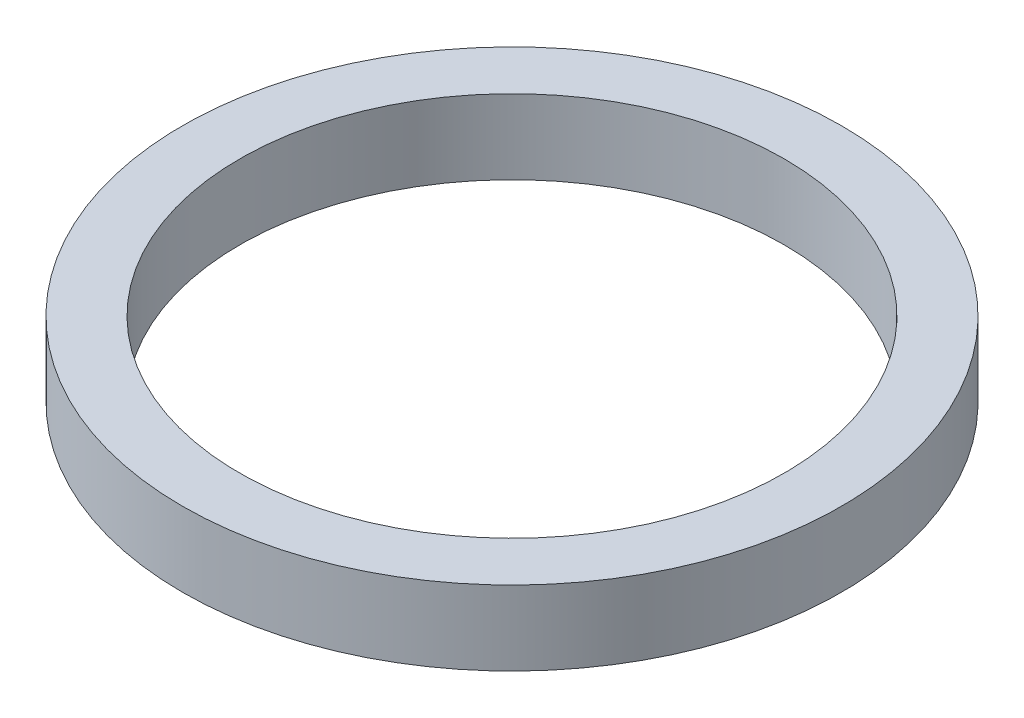
ISO-10303-21;
HEADER;
FILE_DESCRIPTION(('STEP AP214'),'2;1');
FILE_NAME('part.step','',(''),(''),'','','');
FILE_SCHEMA(('AUTOMOTIVE_DESIGN { 1 0 10303 214 1 1 1 1 }'));
ENDSEC;
DATA;
#1=APPLICATION_CONTEXT('core data for automotive mechanical design processes');
#2=APPLICATION_PROTOCOL_DEFINITION('international standard','automotive_design',2000,#1);
#3=PRODUCT_CONTEXT('',#1,'mechanical');
#4=PRODUCT('Part','Part','',(#3));
#5=PRODUCT_RELATED_PRODUCT_CATEGORY('part','',(#4));
#6=PRODUCT_DEFINITION_FORMATION('','',#4);
#7=PRODUCT_DEFINITION_CONTEXT('part definition',#1,'design');
#8=PRODUCT_DEFINITION('design','',#6,#7);
#9=PRODUCT_DEFINITION_SHAPE('','',#8);
#10=(LENGTH_UNIT() NAMED_UNIT(*) SI_UNIT(.MILLI.,.METRE.));
#11=(NAMED_UNIT(*) PLANE_ANGLE_UNIT() SI_UNIT($,.RADIAN.));
#12=(NAMED_UNIT(*) SI_UNIT($,.STERADIAN.) SOLID_ANGLE_UNIT());
#13=UNCERTAINTY_MEASURE_WITH_UNIT(LENGTH_MEASURE(1.E-05),#10,'distance_accuracy_value','');
#14=(GEOMETRIC_REPRESENTATION_CONTEXT(3) GLOBAL_UNCERTAINTY_ASSIGNED_CONTEXT((#13)) GLOBAL_UNIT_ASSIGNED_CONTEXT((#10,
#11,#12)) REPRESENTATION_CONTEXT('',''));
#15=CARTESIAN_POINT('',(0.,0.,0.));
#16=DIRECTION('',(0.,0.,1.));
#17=DIRECTION('',(1.,0.,0.));
#18=AXIS2_PLACEMENT_3D('',#15,#16,#17);
#19=CARTESIAN_POINT('',(0.,13.,0.));
#20=DIRECTION('',(0.,-1.,0.));
#21=DIRECTION('',(0.,0.,-1.));
#22=AXIS2_PLACEMENT_3D('',#19,#20,#21);
#23=CYLINDRICAL_SURFACE('',#22,57.5);
#24=CARTESIAN_POINT('',(0.,13.,0.));
#25=DIRECTION('',(0.,1.,0.));
#26=DIRECTION('',(0.,0.,1.));
#27=AXIS2_PLACEMENT_3D('',#24,#25,#26);
#28=CIRCLE('',#27,57.5);
#29=CARTESIAN_POINT('',(0.,13.,-57.5));
#30=VERTEX_POINT('',#29);
#31=EDGE_CURVE('E10',#30,#30,#28,.T.);
#32=CARTESIAN_POINT('',(0.,0.,0.));
#33=DIRECTION('',(0.,1.,0.));
#34=DIRECTION('',(0.,0.,1.));
#35=AXIS2_PLACEMENT_3D('',#32,#33,#34);
#36=CIRCLE('',#35,57.5);
#37=CARTESIAN_POINT('',(0.,0.,-57.5));
#38=VERTEX_POINT('',#37);
#39=EDGE_CURVE('E37',#38,#38,#36,.T.);
#40=CARTESIAN_POINT('',(0.,13.,-57.5));
#41=CARTESIAN_POINT('',(0.,12.8645833333333,-57.5));
#42=CARTESIAN_POINT('',(0.,12.7291666666667,-57.5));
#43=CARTESIAN_POINT('',(0.,12.4583333333333,-57.5));
#44=CARTESIAN_POINT('',(0.,12.3229166666667,-57.5));
#45=CARTESIAN_POINT('',(0.,12.0520833333333,-57.5));
#46=CARTESIAN_POINT('',(0.,11.9166666666667,-57.5));
#47=CARTESIAN_POINT('',(0.,11.6458333333333,-57.5));
#48=CARTESIAN_POINT('',(0.,11.5104166666667,-57.5));
#49=CARTESIAN_POINT('',(0.,11.2395833333333,-57.5));
#50=CARTESIAN_POINT('',(0.,11.1041666666667,-57.5));
#51=CARTESIAN_POINT('',(0.,10.8333333333333,-57.5));
#52=CARTESIAN_POINT('',(0.,10.6979166666667,-57.5));
#53=CARTESIAN_POINT('',(0.,10.4270833333333,-57.5));
#54=CARTESIAN_POINT('',(0.,10.2916666666667,-57.5));
#55=CARTESIAN_POINT('',(0.,10.0208333333333,-57.5));
#56=CARTESIAN_POINT('',(0.,9.88541666666667,-57.5));
#57=CARTESIAN_POINT('',(0.,9.61458333333333,-57.5));
#58=CARTESIAN_POINT('',(0.,9.47916666666667,-57.5));
#59=CARTESIAN_POINT('',(0.,9.20833333333333,-57.5));
#60=CARTESIAN_POINT('',(0.,9.07291666666667,-57.5));
#61=CARTESIAN_POINT('',(0.,8.80208333333333,-57.5));
#62=CARTESIAN_POINT('',(0.,8.66666666666667,-57.5));
#63=CARTESIAN_POINT('',(0.,8.39583333333333,-57.5));
#64=CARTESIAN_POINT('',(0.,8.26041666666667,-57.5));
#65=CARTESIAN_POINT('',(0.,7.98958333333333,-57.5));
#66=CARTESIAN_POINT('',(0.,7.85416666666667,-57.5));
#67=CARTESIAN_POINT('',(0.,7.58333333333333,-57.5));
#68=CARTESIAN_POINT('',(0.,7.44791666666667,-57.5));
#69=CARTESIAN_POINT('',(0.,7.17708333333333,-57.5));
#70=CARTESIAN_POINT('',(0.,7.04166666666667,-57.5));
#71=CARTESIAN_POINT('',(0.,6.77083333333333,-57.5));
#72=CARTESIAN_POINT('',(0.,6.63541666666667,-57.5));
#73=CARTESIAN_POINT('',(0.,6.36458333333333,-57.5));
#74=CARTESIAN_POINT('',(0.,6.22916666666667,-57.5));
#75=CARTESIAN_POINT('',(0.,5.95833333333333,-57.5));
#76=CARTESIAN_POINT('',(0.,5.82291666666667,-57.5));
#77=CARTESIAN_POINT('',(0.,5.55208333333333,-57.5));
#78=CARTESIAN_POINT('',(0.,5.41666666666667,-57.5));
#79=CARTESIAN_POINT('',(0.,5.14583333333333,-57.5));
#80=CARTESIAN_POINT('',(0.,5.01041666666667,-57.5));
#81=CARTESIAN_POINT('',(0.,4.73958333333333,-57.5));
#82=CARTESIAN_POINT('',(0.,4.60416666666667,-57.5));
#83=CARTESIAN_POINT('',(0.,4.33333333333333,-57.5));
#84=CARTESIAN_POINT('',(0.,4.19791666666667,-57.5));
#85=CARTESIAN_POINT('',(0.,3.92708333333333,-57.5));
#86=CARTESIAN_POINT('',(0.,3.79166666666667,-57.5));
#87=CARTESIAN_POINT('',(0.,3.52083333333333,-57.5));
#88=CARTESIAN_POINT('',(0.,3.38541666666667,-57.5));
#89=CARTESIAN_POINT('',(0.,3.11458333333333,-57.5));
#90=CARTESIAN_POINT('',(0.,2.97916666666667,-57.5));
#91=CARTESIAN_POINT('',(0.,2.70833333333333,-57.5));
#92=CARTESIAN_POINT('',(0.,2.57291666666667,-57.5));
#93=CARTESIAN_POINT('',(0.,2.30208333333333,-57.5));
#94=CARTESIAN_POINT('',(0.,2.16666666666667,-57.5));
#95=CARTESIAN_POINT('',(0.,1.89583333333333,-57.5));
#96=CARTESIAN_POINT('',(0.,1.76041666666667,-57.5));
#97=CARTESIAN_POINT('',(0.,1.48958333333333,-57.5));
#98=CARTESIAN_POINT('',(0.,1.35416666666667,-57.5));
#99=CARTESIAN_POINT('',(0.,1.08333333333333,-57.5));
#100=CARTESIAN_POINT('',(0.,0.947916666666667,-57.5));
#101=CARTESIAN_POINT('',(0.,0.677083333333334,-57.5));
#102=CARTESIAN_POINT('',(0.,0.541666666666667,-57.5));
#103=CARTESIAN_POINT('',(0.,0.270833333333334,-57.5));
#104=CARTESIAN_POINT('',(0.,0.135416666666667,-57.5));
#105=CARTESIAN_POINT('',(0.,0.,-57.5));
#106=B_SPLINE_CURVE_WITH_KNOTS('',3,(#40,#41,#42,#43,#44,#45,#46,#47,#48,#49,#50,#51,#52,#53,
#54,#55,#56,#57,#58,#59,#60,#61,#62,#63,#64,#65,#66,#67,#68,#69,#70,#71,#72,#73,#74,#75,#76,#77,
#78,#79,#80,#81,#82,#83,#84,#85,#86,#87,#88,#89,#90,#91,#92,#93,#94,#95,#96,#97,#98,#99,#100,
#101,#102,#103,#104,#105),.UNSPECIFIED.,.F.,.F.,(4,2,2,2,2,2,2,2,2,2,2,2,2,2,2,2,2,2,2,2,2,2,2,
2,2,2,2,2,2,2,2,2,4),(0.,0.406249999999999,0.812499999999999,1.21875,1.625,2.03125,2.4375,
2.84375,3.25,3.65625,4.0625,4.46875,4.875,5.28125,5.6875,6.09375,6.5,6.90625,7.3125,7.71875,
8.125,8.53125,8.9375,9.34375,9.75,10.15625,10.5625,10.96875,11.375,11.78125,12.1875,12.59375,
13.),.UNSPECIFIED.);
#107=EDGE_CURVE('BSEAM40',#30,#38,#106,.T.);
#108=ORIENTED_EDGE('',*,*,#31,.F.);
#109=ORIENTED_EDGE('',*,*,#39,.T.);
#110=ORIENTED_EDGE('',*,*,#107,.T.);
#111=ORIENTED_EDGE('',*,*,#107,.F.);
#112=EDGE_LOOP('',(#108,#110,#109,#111));
#113=FACE_BOUND('',#112,.T.);
#114=ADVANCED_FACE('F40',(#113),#23,.T.);
#115=CARTESIAN_POINT('',(0.,13.,0.));
#116=DIRECTION('',(0.,1.,0.));
#117=DIRECTION('',(0.,0.,1.));
#118=AXIS2_PLACEMENT_3D('',#115,#116,#117);
#119=PLANE('',#118);
#120=CARTESIAN_POINT('',(0.,13.,0.));
#121=DIRECTION('',(0.,1.,0.));
#122=DIRECTION('',(0.,0.,1.));
#123=AXIS2_PLACEMENT_3D('',#120,#121,#122);
#124=CIRCLE('',#123,47.5);
#125=CARTESIAN_POINT('',(0.,13.,-47.5));
#126=VERTEX_POINT('',#125);
#127=EDGE_CURVE('E50',#126,#126,#124,.T.);
#128=ORIENTED_EDGE('',*,*,#127,.F.);
#129=EDGE_LOOP('',(#128));
#130=FACE_BOUND('',#129,.T.);
#131=ORIENTED_EDGE('',*,*,#31,.T.);
#132=EDGE_LOOP('',(#131));
#133=FACE_BOUND('',#132,.T.);
#134=ADVANCED_FACE('F59',(#130,#133),#119,.T.);
#135=CARTESIAN_POINT('',(0.,0.,0.));
#136=DIRECTION('',(0.,1.,0.));
#137=DIRECTION('',(0.,0.,1.));
#138=AXIS2_PLACEMENT_3D('',#135,#136,#137);
#139=PLANE('',#138);
#140=CARTESIAN_POINT('',(0.,0.,0.));
#141=DIRECTION('',(0.,1.,0.));
#142=DIRECTION('',(0.,0.,1.));
#143=AXIS2_PLACEMENT_3D('',#140,#141,#142);
#144=CIRCLE('',#143,47.5);
#145=CARTESIAN_POINT('',(0.,0.,-47.5));
#146=VERTEX_POINT('',#145);
#147=EDGE_CURVE('E47',#146,#146,#144,.T.);
#148=ORIENTED_EDGE('',*,*,#147,.T.);
#149=EDGE_LOOP('',(#148));
#150=FACE_BOUND('',#149,.T.);
#151=ORIENTED_EDGE('',*,*,#39,.F.);
#152=EDGE_LOOP('',(#151));
#153=FACE_BOUND('',#152,.T.);
#154=ADVANCED_FACE('F58',(#150,#153),#139,.F.);
#155=CARTESIAN_POINT('',(0.,13.,0.));
#156=DIRECTION('',(0.,-1.,0.));
#157=DIRECTION('',(0.,0.,-1.));
#158=AXIS2_PLACEMENT_3D('',#155,#156,#157);
#159=CYLINDRICAL_SURFACE('',#158,47.5);
#160=CARTESIAN_POINT('',(0.,13.,-47.5));
#161=CARTESIAN_POINT('',(0.,12.8645833333333,-47.5));
#162=CARTESIAN_POINT('',(0.,12.7291666666667,-47.5));
#163=CARTESIAN_POINT('',(0.,12.4583333333333,-47.5));
#164=CARTESIAN_POINT('',(0.,12.3229166666667,-47.5));
#165=CARTESIAN_POINT('',(0.,12.0520833333333,-47.5));
#166=CARTESIAN_POINT('',(0.,11.9166666666667,-47.5));
#167=CARTESIAN_POINT('',(0.,11.6458333333333,-47.5));
#168=CARTESIAN_POINT('',(0.,11.5104166666667,-47.5));
#169=CARTESIAN_POINT('',(0.,11.2395833333333,-47.5));
#170=CARTESIAN_POINT('',(0.,11.1041666666667,-47.5));
#171=CARTESIAN_POINT('',(0.,10.8333333333333,-47.5));
#172=CARTESIAN_POINT('',(0.,10.6979166666667,-47.5));
#173=CARTESIAN_POINT('',(0.,10.4270833333333,-47.5));
#174=CARTESIAN_POINT('',(0.,10.2916666666667,-47.5));
#175=CARTESIAN_POINT('',(0.,10.0208333333333,-47.5));
#176=CARTESIAN_POINT('',(0.,9.88541666666667,-47.5));
#177=CARTESIAN_POINT('',(0.,9.61458333333333,-47.5));
#178=CARTESIAN_POINT('',(0.,9.47916666666667,-47.5));
#179=CARTESIAN_POINT('',(0.,9.20833333333333,-47.5));
#180=CARTESIAN_POINT('',(0.,9.07291666666666,-47.5));
#181=CARTESIAN_POINT('',(0.,8.80208333333333,-47.5));
#182=CARTESIAN_POINT('',(0.,8.66666666666667,-47.5));
#183=CARTESIAN_POINT('',(0.,8.39583333333333,-47.5));
#184=CARTESIAN_POINT('',(0.,8.26041666666667,-47.5));
#185=CARTESIAN_POINT('',(0.,7.98958333333333,-47.5));
#186=CARTESIAN_POINT('',(0.,7.85416666666667,-47.5));
#187=CARTESIAN_POINT('',(0.,7.58333333333333,-47.5));
#188=CARTESIAN_POINT('',(0.,7.44791666666667,-47.5));
#189=CARTESIAN_POINT('',(0.,7.17708333333333,-47.5));
#190=CARTESIAN_POINT('',(0.,7.04166666666667,-47.5));
#191=CARTESIAN_POINT('',(0.,6.77083333333333,-47.5));
#192=CARTESIAN_POINT('',(0.,6.63541666666667,-47.5));
#193=CARTESIAN_POINT('',(0.,6.36458333333333,-47.5));
#194=CARTESIAN_POINT('',(0.,6.22916666666667,-47.5));
#195=CARTESIAN_POINT('',(0.,5.95833333333333,-47.5));
#196=CARTESIAN_POINT('',(0.,5.82291666666667,-47.5));
#197=CARTESIAN_POINT('',(0.,5.55208333333333,-47.5));
#198=CARTESIAN_POINT('',(0.,5.41666666666667,-47.5));
#199=CARTESIAN_POINT('',(0.,5.14583333333333,-47.5));
#200=CARTESIAN_POINT('',(0.,5.01041666666667,-47.5));
#201=CARTESIAN_POINT('',(0.,4.73958333333333,-47.5));
#202=CARTESIAN_POINT('',(0.,4.60416666666667,-47.5));
#203=CARTESIAN_POINT('',(0.,4.33333333333333,-47.5));
#204=CARTESIAN_POINT('',(0.,4.19791666666667,-47.5));
#205=CARTESIAN_POINT('',(0.,3.92708333333333,-47.5));
#206=CARTESIAN_POINT('',(0.,3.79166666666667,-47.5));
#207=CARTESIAN_POINT('',(0.,3.52083333333333,-47.5));
#208=CARTESIAN_POINT('',(0.,3.38541666666667,-47.5));
#209=CARTESIAN_POINT('',(0.,3.11458333333333,-47.5));
#210=CARTESIAN_POINT('',(0.,2.97916666666667,-47.5));
#211=CARTESIAN_POINT('',(0.,2.70833333333333,-47.5));
#212=CARTESIAN_POINT('',(0.,2.57291666666667,-47.5));
#213=CARTESIAN_POINT('',(0.,2.30208333333333,-47.5));
#214=CARTESIAN_POINT('',(0.,2.16666666666667,-47.5));
#215=CARTESIAN_POINT('',(0.,1.89583333333333,-47.5));
#216=CARTESIAN_POINT('',(0.,1.76041666666667,-47.5));
#217=CARTESIAN_POINT('',(0.,1.48958333333333,-47.5));
#218=CARTESIAN_POINT('',(0.,1.35416666666667,-47.5));
#219=CARTESIAN_POINT('',(0.,1.08333333333333,-47.5));
#220=CARTESIAN_POINT('',(0.,0.947916666666667,-47.5));
#221=CARTESIAN_POINT('',(0.,0.677083333333334,-47.5));
#222=CARTESIAN_POINT('',(0.,0.541666666666667,-47.5));
#223=CARTESIAN_POINT('',(0.,0.270833333333334,-47.5));
#224=CARTESIAN_POINT('',(0.,0.135416666666667,-47.5));
#225=CARTESIAN_POINT('',(0.,0.,-47.5));
#226=B_SPLINE_CURVE_WITH_KNOTS('',3,(#160,#161,#162,#163,#164,#165,#166,#167,#168,#169,#170,
#171,#172,#173,#174,#175,#176,#177,#178,#179,#180,#181,#182,#183,#184,#185,#186,#187,#188,#189,
#190,#191,#192,#193,#194,#195,#196,#197,#198,#199,#200,#201,#202,#203,#204,#205,#206,#207,#208,
#209,#210,#211,#212,#213,#214,#215,#216,#217,#218,#219,#220,#221,#222,#223,#224,#225),
.UNSPECIFIED.,.F.,.F.,(4,2,2,2,2,2,2,2,2,2,2,2,2,2,2,2,2,2,2,2,2,2,2,2,2,2,2,2,2,2,2,2,4),(0.,
0.40625,0.812500000000001,1.21875,1.625,2.03125,2.4375,2.84375,3.25,3.65625,4.0625,4.46875,
4.875,5.28125,5.6875,6.09375,6.5,6.90625,7.3125,7.71875,8.125,8.53125,8.9375,9.34375,9.75,
10.15625,10.5625,10.96875,11.375,11.78125,12.1875,12.59375,13.),.UNSPECIFIED.);
#227=EDGE_CURVE('BSEAM54',#126,#146,#226,.T.);
#228=ORIENTED_EDGE('',*,*,#127,.T.);
#229=ORIENTED_EDGE('',*,*,#147,.F.);
#230=ORIENTED_EDGE('',*,*,#227,.T.);
#231=ORIENTED_EDGE('',*,*,#227,.F.);
#232=EDGE_LOOP('',(#228,#230,#229,#231));
#233=FACE_BOUND('',#232,.T.);
#234=ADVANCED_FACE('F54',(#233),#159,.F.);
#235=CLOSED_SHELL('',(#114,#134,#154,#234));
#236=MANIFOLD_SOLID_BREP('B2',#235);
#237=ADVANCED_BREP_SHAPE_REPRESENTATION('',(#18,#236),#14);
#238=SHAPE_DEFINITION_REPRESENTATION(#9,#237);
ENDSEC;
END-ISO-10303-21;
